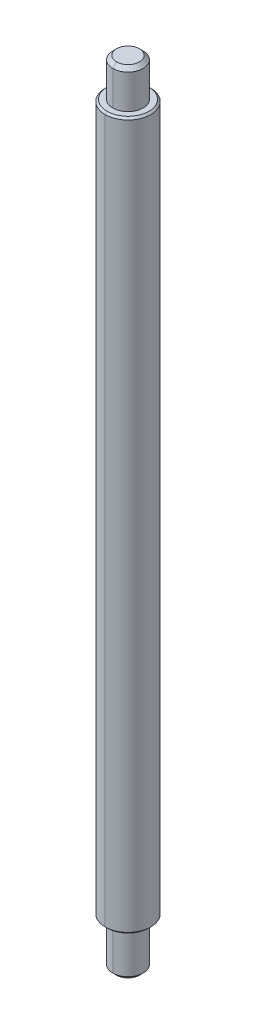
ISO-10303-21;
HEADER;
FILE_DESCRIPTION(('STEP AP214'),'2;1');
FILE_NAME('part.step','',(''),(''),'','','');
FILE_SCHEMA(('AUTOMOTIVE_DESIGN { 1 0 10303 214 1 1 1 1 }'));
ENDSEC;
DATA;
#1=APPLICATION_CONTEXT('core data for automotive mechanical design processes');
#2=APPLICATION_PROTOCOL_DEFINITION('international standard','automotive_design',2000,#1);
#3=PRODUCT_CONTEXT('',#1,'mechanical');
#4=PRODUCT('Part','Part','',(#3));
#5=PRODUCT_RELATED_PRODUCT_CATEGORY('part','',(#4));
#6=PRODUCT_DEFINITION_FORMATION('','',#4);
#7=PRODUCT_DEFINITION_CONTEXT('part definition',#1,'design');
#8=PRODUCT_DEFINITION('design','',#6,#7);
#9=PRODUCT_DEFINITION_SHAPE('','',#8);
#10=(LENGTH_UNIT() NAMED_UNIT(*) SI_UNIT(.MILLI.,.METRE.));
#11=(NAMED_UNIT(*) PLANE_ANGLE_UNIT() SI_UNIT($,.RADIAN.));
#12=(NAMED_UNIT(*) SI_UNIT($,.STERADIAN.) SOLID_ANGLE_UNIT());
#13=UNCERTAINTY_MEASURE_WITH_UNIT(LENGTH_MEASURE(1.E-05),#10,'distance_accuracy_value','');
#14=(GEOMETRIC_REPRESENTATION_CONTEXT(3) GLOBAL_UNCERTAINTY_ASSIGNED_CONTEXT((#13)) GLOBAL_UNIT_ASSIGNED_CONTEXT((#10,
#11,#12)) REPRESENTATION_CONTEXT('',''));
#15=CARTESIAN_POINT('',(0.,0.,0.));
#16=DIRECTION('',(0.,0.,1.));
#17=DIRECTION('',(1.,0.,0.));
#18=AXIS2_PLACEMENT_3D('',#15,#16,#17);
#19=CARTESIAN_POINT('',(0.,6.25,0.));
#20=DIRECTION('',(0.,1.,0.));
#21=DIRECTION('',(0.,0.,1.));
#22=AXIS2_PLACEMENT_3D('',#19,#20,#21);
#23=CONICAL_SURFACE('',#22,3.,0.785398163397442);
#24=CARTESIAN_POINT('',(0.,6.,0.));
#25=DIRECTION('',(0.,-1.,0.));
#26=DIRECTION('',(0.,0.,-1.));
#27=AXIS2_PLACEMENT_3D('',#24,#25,#26);
#28=CIRCLE('',#27,2.75);
#29=CARTESIAN_POINT('',(0.,6.,-2.75));
#30=VERTEX_POINT('',#29);
#31=CARTESIAN_POINT('',(0.,6.,2.75));
#32=VERTEX_POINT('',#31);
#33=EDGE_CURVE('E41',#30,#32,#28,.T.);
#34=ORIENTED_EDGE('',*,*,#33,.F.);
#35=DIRECTION('',(0.,0.707106781186552,-0.707106781186543));
#36=VECTOR('',#35,1.);
#37=CARTESIAN_POINT('',(0.,6.25,-3.));
#38=LINE('',#37,#36);
#39=CARTESIAN_POINT('',(0.,6.25,-3.));
#40=VERTEX_POINT('',#39);
#41=EDGE_CURVE('E11',#30,#40,#38,.T.);
#42=ORIENTED_EDGE('',*,*,#41,.T.);
#43=CARTESIAN_POINT('',(0.,6.25,0.));
#44=DIRECTION('',(0.,1.,0.));
#45=DIRECTION('',(0.,0.,-1.));
#46=AXIS2_PLACEMENT_3D('',#43,#44,#45);
#47=CIRCLE('',#46,3.);
#48=CARTESIAN_POINT('',(0.,6.25,3.));
#49=VERTEX_POINT('',#48);
#50=EDGE_CURVE('E233',#49,#40,#47,.T.);
#51=ORIENTED_EDGE('',*,*,#50,.F.);
#52=DIRECTION('',(0.,0.707106781186552,0.707106781186543));
#53=VECTOR('',#52,1.);
#54=CARTESIAN_POINT('',(0.,6.25,3.));
#55=LINE('',#54,#53);
#56=EDGE_CURVE('E182',#32,#49,#55,.T.);
#57=ORIENTED_EDGE('',*,*,#56,.F.);
#58=EDGE_LOOP('',(#34,#42,#51,#57));
#59=FACE_BOUND('',#58,.T.);
#60=ADVANCED_FACE('F16',(#59),#23,.T.);
#61=CARTESIAN_POINT('',(0.,99.,0.));
#62=DIRECTION('',(0.,-1.,0.));
#63=DIRECTION('',(0.,0.,-1.));
#64=AXIS2_PLACEMENT_3D('',#61,#62,#63);
#65=CONICAL_SURFACE('',#64,2.75,0.785398163397426);
#66=CARTESIAN_POINT('',(0.,99.,0.));
#67=DIRECTION('',(0.,1.,0.));
#68=DIRECTION('',(0.,0.,1.));
#69=AXIS2_PLACEMENT_3D('',#66,#67,#68);
#70=CIRCLE('',#69,2.75);
#71=CARTESIAN_POINT('',(0.,99.,2.75));
#72=VERTEX_POINT('',#71);
#73=CARTESIAN_POINT('',(0.,99.,-2.75));
#74=VERTEX_POINT('',#73);
#75=EDGE_CURVE('E193',#72,#74,#70,.T.);
#76=ORIENTED_EDGE('',*,*,#75,.F.);
#77=DIRECTION('',(0.,-0.707106781186563,0.707106781186532));
#78=VECTOR('',#77,1.);
#79=CARTESIAN_POINT('',(0.,99.,2.75));
#80=LINE('',#79,#78);
#81=CARTESIAN_POINT('',(0.,98.75,3.));
#82=VERTEX_POINT('',#81);
#83=EDGE_CURVE('E27',#72,#82,#80,.T.);
#84=ORIENTED_EDGE('',*,*,#83,.T.);
#85=CARTESIAN_POINT('',(0.,98.75,0.));
#86=DIRECTION('',(0.,-1.,0.));
#87=DIRECTION('',(0.,0.,1.));
#88=AXIS2_PLACEMENT_3D('',#85,#86,#87);
#89=CIRCLE('',#88,3.);
#90=CARTESIAN_POINT('',(0.,98.75,-3.));
#91=VERTEX_POINT('',#90);
#92=EDGE_CURVE('E177',#91,#82,#89,.T.);
#93=ORIENTED_EDGE('',*,*,#92,.F.);
#94=DIRECTION('',(0.,-0.707106781186563,-0.707106781186532));
#95=VECTOR('',#94,1.);
#96=CARTESIAN_POINT('',(0.,99.,-2.75));
#97=LINE('',#96,#95);
#98=EDGE_CURVE('E179',#74,#91,#97,.T.);
#99=ORIENTED_EDGE('',*,*,#98,.F.);
#100=EDGE_LOOP('',(#76,#84,#93,#99));
#101=FACE_BOUND('',#100,.T.);
#102=ADVANCED_FACE('F416',(#101),#65,.T.);
#103=CARTESIAN_POINT('',(0.,0.499999999999993,0.));
#104=DIRECTION('',(0.,1.,0.));
#105=DIRECTION('',(0.,0.,1.));
#106=AXIS2_PLACEMENT_3D('',#103,#104,#105);
#107=CONICAL_SURFACE('',#106,2.,0.785398163397442);
#108=CARTESIAN_POINT('',(0.,0.,0.));
#109=DIRECTION('',(0.,-1.,0.));
#110=DIRECTION('',(0.,0.,-1.));
#111=AXIS2_PLACEMENT_3D('',#108,#109,#110);
#112=CIRCLE('',#111,1.5);
#113=CARTESIAN_POINT('',(0.,0.,-1.5));
#114=VERTEX_POINT('',#113);
#115=CARTESIAN_POINT('',(0.,0.,1.5));
#116=VERTEX_POINT('',#115);
#117=EDGE_CURVE('E145',#114,#116,#112,.T.);
#118=ORIENTED_EDGE('',*,*,#117,.F.);
#119=DIRECTION('',(0.,0.707106781186553,-0.707106781186543));
#120=VECTOR('',#119,1.);
#121=CARTESIAN_POINT('',(0.,0.499999999999993,-2.));
#122=LINE('',#121,#120);
#123=CARTESIAN_POINT('',(0.,0.499999999999993,-2.));
#124=VERTEX_POINT('',#123);
#125=EDGE_CURVE('E20',#114,#124,#122,.T.);
#126=ORIENTED_EDGE('',*,*,#125,.T.);
#127=CARTESIAN_POINT('',(0.,0.499999999999993,0.));
#128=DIRECTION('',(0.,1.,0.));
#129=DIRECTION('',(0.,0.,-1.));
#130=AXIS2_PLACEMENT_3D('',#127,#128,#129);
#131=CIRCLE('',#130,2.);
#132=CARTESIAN_POINT('',(0.,0.499999999999993,2.));
#133=VERTEX_POINT('',#132);
#134=EDGE_CURVE('E221',#133,#124,#131,.T.);
#135=ORIENTED_EDGE('',*,*,#134,.F.);
#136=DIRECTION('',(0.,0.707106781186553,0.707106781186543));
#137=VECTOR('',#136,1.);
#138=CARTESIAN_POINT('',(0.,0.499999999999993,2.));
#139=LINE('',#138,#137);
#140=EDGE_CURVE('E111',#116,#133,#139,.T.);
#141=ORIENTED_EDGE('',*,*,#140,.F.);
#142=EDGE_LOOP('',(#118,#126,#135,#141));
#143=FACE_BOUND('',#142,.T.);
#144=ADVANCED_FACE('F421',(#143),#107,.T.);
#145=CARTESIAN_POINT('',(0.,104.,0.));
#146=DIRECTION('',(0.,-1.,0.));
#147=DIRECTION('',(0.,0.,-1.));
#148=AXIS2_PLACEMENT_3D('',#145,#146,#147);
#149=CONICAL_SURFACE('',#148,1.50000000000003,0.785398163397445);
#150=CARTESIAN_POINT('',(0.,104.,0.));
#151=DIRECTION('',(0.,1.,0.));
#152=DIRECTION('',(0.,0.,1.));
#153=AXIS2_PLACEMENT_3D('',#150,#151,#152);
#154=CIRCLE('',#153,1.50000000000003);
#155=CARTESIAN_POINT('',(0.,104.,1.50000000000003));
#156=VERTEX_POINT('',#155);
#157=CARTESIAN_POINT('',(0.,104.,-1.50000000000003));
#158=VERTEX_POINT('',#157);
#159=EDGE_CURVE('E125',#156,#158,#154,.T.);
#160=ORIENTED_EDGE('',*,*,#159,.F.);
#161=DIRECTION('',(0.,-0.70710678118655,0.707106781186545));
#162=VECTOR('',#161,1.);
#163=CARTESIAN_POINT('',(0.,104.,1.50000000000003));
#164=LINE('',#163,#162);
#165=CARTESIAN_POINT('',(0.,103.5,2.));
#166=VERTEX_POINT('',#165);
#167=EDGE_CURVE('E143',#156,#166,#164,.T.);
#168=ORIENTED_EDGE('',*,*,#167,.T.);
#169=CARTESIAN_POINT('',(0.,103.5,0.));
#170=DIRECTION('',(0.,-1.,0.));
#171=DIRECTION('',(0.,0.,1.));
#172=AXIS2_PLACEMENT_3D('',#169,#170,#171);
#173=CIRCLE('',#172,2.);
#174=CARTESIAN_POINT('',(0.,103.5,-2.));
#175=VERTEX_POINT('',#174);
#176=EDGE_CURVE('E128',#175,#166,#173,.T.);
#177=ORIENTED_EDGE('',*,*,#176,.F.);
#178=DIRECTION('',(0.,-0.70710678118655,-0.707106781186545));
#179=VECTOR('',#178,1.);
#180=CARTESIAN_POINT('',(0.,104.,-1.50000000000003));
#181=LINE('',#180,#179);
#182=EDGE_CURVE('E121',#158,#175,#181,.T.);
#183=ORIENTED_EDGE('',*,*,#182,.F.);
#184=EDGE_LOOP('',(#160,#168,#177,#183));
#185=FACE_BOUND('',#184,.T.);
#186=ADVANCED_FACE('F123',(#185),#149,.T.);
#187=CARTESIAN_POINT('',(0.,0.,0.));
#188=DIRECTION('',(0.,1.,0.));
#189=DIRECTION('',(0.,0.,1.));
#190=AXIS2_PLACEMENT_3D('',#187,#188,#189);
#191=CYLINDRICAL_SURFACE('',#190,2.);
#192=ORIENTED_EDGE('',*,*,#134,.T.);
#193=DIRECTION('',(0.,1.,0.));
#194=VECTOR('',#193,1.);
#195=CARTESIAN_POINT('',(0.,0.,-2.));
#196=LINE('',#195,#194);
#197=CARTESIAN_POINT('',(0.,6.,-2.));
#198=VERTEX_POINT('',#197);
#199=EDGE_CURVE('E99',#124,#198,#196,.T.);
#200=ORIENTED_EDGE('',*,*,#199,.T.);
#201=CARTESIAN_POINT('',(0.,6.,0.));
#202=DIRECTION('',(0.,1.,0.));
#203=DIRECTION('',(0.,0.,1.));
#204=AXIS2_PLACEMENT_3D('',#201,#202,#203);
#205=CIRCLE('',#204,2.);
#206=CARTESIAN_POINT('',(0.,6.,2.));
#207=VERTEX_POINT('',#206);
#208=EDGE_CURVE('E165',#207,#198,#205,.T.);
#209=ORIENTED_EDGE('',*,*,#208,.F.);
#210=DIRECTION('',(0.,1.,0.));
#211=VECTOR('',#210,1.);
#212=CARTESIAN_POINT('',(0.,0.,2.));
#213=LINE('',#212,#211);
#214=EDGE_CURVE('E134',#133,#207,#213,.T.);
#215=ORIENTED_EDGE('',*,*,#214,.F.);
#216=EDGE_LOOP('',(#192,#200,#209,#215));
#217=FACE_BOUND('',#216,.T.);
#218=ADVANCED_FACE('F438',(#217),#191,.T.);
#219=CARTESIAN_POINT('',(0.,0.,0.));
#220=DIRECTION('',(0.,1.,0.));
#221=DIRECTION('',(0.,0.,1.));
#222=AXIS2_PLACEMENT_3D('',#219,#220,#221);
#223=CYLINDRICAL_SURFACE('',#222,3.);
#224=ORIENTED_EDGE('',*,*,#50,.T.);
#225=DIRECTION('',(0.,1.,0.));
#226=VECTOR('',#225,1.);
#227=CARTESIAN_POINT('',(0.,0.,-3.));
#228=LINE('',#227,#226);
#229=EDGE_CURVE('E225',#40,#91,#228,.T.);
#230=ORIENTED_EDGE('',*,*,#229,.T.);
#231=ORIENTED_EDGE('',*,*,#92,.T.);
#232=DIRECTION('',(0.,1.,0.));
#233=VECTOR('',#232,1.);
#234=CARTESIAN_POINT('',(0.,0.,3.));
#235=LINE('',#234,#233);
#236=EDGE_CURVE('E198',#49,#82,#235,.T.);
#237=ORIENTED_EDGE('',*,*,#236,.F.);
#238=EDGE_LOOP('',(#224,#230,#231,#237));
#239=FACE_BOUND('',#238,.T.);
#240=ADVANCED_FACE('F432',(#239),#223,.T.);
#241=CARTESIAN_POINT('',(0.,0.,0.));
#242=DIRECTION('',(0.,1.,0.));
#243=DIRECTION('',(0.,0.,1.));
#244=AXIS2_PLACEMENT_3D('',#241,#242,#243);
#245=CYLINDRICAL_SURFACE('',#244,2.);
#246=CARTESIAN_POINT('',(0.,99.,0.));
#247=DIRECTION('',(0.,1.,0.));
#248=DIRECTION('',(0.,0.,1.));
#249=AXIS2_PLACEMENT_3D('',#246,#247,#248);
#250=CIRCLE('',#249,2.);
#251=CARTESIAN_POINT('',(0.,99.,2.));
#252=VERTEX_POINT('',#251);
#253=CARTESIAN_POINT('',(0.,99.,-2.));
#254=VERTEX_POINT('',#253);
#255=EDGE_CURVE('E173',#252,#254,#250,.T.);
#256=ORIENTED_EDGE('',*,*,#255,.T.);
#257=DIRECTION('',(0.,1.,0.));
#258=VECTOR('',#257,1.);
#259=CARTESIAN_POINT('',(0.,0.,-2.));
#260=LINE('',#259,#258);
#261=EDGE_CURVE('E178',#254,#175,#260,.T.);
#262=ORIENTED_EDGE('',*,*,#261,.T.);
#263=ORIENTED_EDGE('',*,*,#176,.T.);
#264=DIRECTION('',(0.,1.,0.));
#265=VECTOR('',#264,1.);
#266=CARTESIAN_POINT('',(0.,0.,2.));
#267=LINE('',#266,#265);
#268=EDGE_CURVE('E172',#252,#166,#267,.T.);
#269=ORIENTED_EDGE('',*,*,#268,.F.);
#270=EDGE_LOOP('',(#256,#262,#263,#269));
#271=FACE_BOUND('',#270,.T.);
#272=ADVANCED_FACE('F437',(#271),#245,.T.);
#273=CARTESIAN_POINT('',(-2.,0.,0.));
#274=DIRECTION('',(0.,-1.,0.));
#275=DIRECTION('',(0.,0.,-1.));
#276=AXIS2_PLACEMENT_3D('',#273,#274,#275);
#277=PLANE('',#276);
#278=CARTESIAN_POINT('',(0.,0.,0.));
#279=DIRECTION('',(0.,-1.,0.));
#280=DIRECTION('',(0.,0.,-1.));
#281=AXIS2_PLACEMENT_3D('',#278,#279,#280);
#282=CIRCLE('',#281,1.5);
#283=EDGE_CURVE('E152',#116,#114,#282,.T.);
#284=ORIENTED_EDGE('',*,*,#283,.T.);
#285=ORIENTED_EDGE('',*,*,#117,.T.);
#286=EDGE_LOOP('',(#284,#285));
#287=FACE_BOUND('',#286,.T.);
#288=ADVANCED_FACE('F468',(#287),#277,.T.);
#289=CARTESIAN_POINT('',(0.,104.,0.));
#290=DIRECTION('',(0.,1.,0.));
#291=DIRECTION('',(1.,0.,0.));
#292=AXIS2_PLACEMENT_3D('',#289,#290,#291);
#293=PLANE('',#292);
#294=CARTESIAN_POINT('',(0.,104.,0.));
#295=DIRECTION('',(0.,1.,0.));
#296=DIRECTION('',(0.,0.,1.));
#297=AXIS2_PLACEMENT_3D('',#294,#295,#296);
#298=CIRCLE('',#297,1.50000000000003);
#299=EDGE_CURVE('E139',#158,#156,#298,.T.);
#300=ORIENTED_EDGE('',*,*,#299,.T.);
#301=ORIENTED_EDGE('',*,*,#159,.T.);
#302=EDGE_LOOP('',(#300,#301));
#303=FACE_BOUND('',#302,.T.);
#304=ADVANCED_FACE('F138',(#303),#293,.T.);
#305=CARTESIAN_POINT('',(0.,0.,0.));
#306=DIRECTION('',(0.,1.,0.));
#307=DIRECTION('',(0.,0.,1.));
#308=AXIS2_PLACEMENT_3D('',#305,#306,#307);
#309=CYLINDRICAL_SURFACE('',#308,2.);
#310=ORIENTED_EDGE('',*,*,#261,.F.);
#311=CARTESIAN_POINT('',(0.,99.,0.));
#312=DIRECTION('',(0.,1.,0.));
#313=DIRECTION('',(0.,0.,1.));
#314=AXIS2_PLACEMENT_3D('',#311,#312,#313);
#315=CIRCLE('',#314,2.);
#316=EDGE_CURVE('E141',#254,#252,#315,.T.);
#317=ORIENTED_EDGE('',*,*,#316,.T.);
#318=ORIENTED_EDGE('',*,*,#268,.T.);
#319=CARTESIAN_POINT('',(0.,103.5,0.));
#320=DIRECTION('',(0.,-1.,0.));
#321=DIRECTION('',(0.,0.,1.));
#322=AXIS2_PLACEMENT_3D('',#319,#320,#321);
#323=CIRCLE('',#322,2.);
#324=EDGE_CURVE('E185',#166,#175,#323,.T.);
#325=ORIENTED_EDGE('',*,*,#324,.T.);
#326=EDGE_LOOP('',(#310,#317,#318,#325));
#327=FACE_BOUND('',#326,.T.);
#328=ADVANCED_FACE('F467',(#327),#309,.T.);
#329=CARTESIAN_POINT('',(-2.,99.,0.));
#330=DIRECTION('',(0.,1.,0.));
#331=DIRECTION('',(1.,0.,0.));
#332=AXIS2_PLACEMENT_3D('',#329,#330,#331);
#333=PLANE('',#332);
#334=CARTESIAN_POINT('',(0.,99.,0.));
#335=DIRECTION('',(0.,1.,0.));
#336=DIRECTION('',(0.,0.,1.));
#337=AXIS2_PLACEMENT_3D('',#334,#335,#336);
#338=CIRCLE('',#337,2.75);
#339=EDGE_CURVE('E189',#74,#72,#338,.T.);
#340=ORIENTED_EDGE('',*,*,#339,.T.);
#341=ORIENTED_EDGE('',*,*,#75,.T.);
#342=EDGE_LOOP('',(#340,#341));
#343=FACE_BOUND('',#342,.T.);
#344=ORIENTED_EDGE('',*,*,#255,.F.);
#345=ORIENTED_EDGE('',*,*,#316,.F.);
#346=EDGE_LOOP('',(#344,#345));
#347=FACE_BOUND('',#346,.T.);
#348=ADVANCED_FACE('F454',(#343,#347),#333,.T.);
#349=CARTESIAN_POINT('',(0.,0.,0.));
#350=DIRECTION('',(0.,1.,0.));
#351=DIRECTION('',(0.,0.,1.));
#352=AXIS2_PLACEMENT_3D('',#349,#350,#351);
#353=CYLINDRICAL_SURFACE('',#352,3.);
#354=ORIENTED_EDGE('',*,*,#229,.F.);
#355=CARTESIAN_POINT('',(0.,6.25,0.));
#356=DIRECTION('',(0.,1.,0.));
#357=DIRECTION('',(0.,0.,-1.));
#358=AXIS2_PLACEMENT_3D('',#355,#356,#357);
#359=CIRCLE('',#358,3.);
#360=EDGE_CURVE('E194',#40,#49,#359,.T.);
#361=ORIENTED_EDGE('',*,*,#360,.T.);
#362=ORIENTED_EDGE('',*,*,#236,.T.);
#363=CARTESIAN_POINT('',(0.,98.75,0.));
#364=DIRECTION('',(0.,-1.,0.));
#365=DIRECTION('',(0.,0.,1.));
#366=AXIS2_PLACEMENT_3D('',#363,#364,#365);
#367=CIRCLE('',#366,3.);
#368=EDGE_CURVE('E201',#82,#91,#367,.T.);
#369=ORIENTED_EDGE('',*,*,#368,.T.);
#370=EDGE_LOOP('',(#354,#361,#362,#369));
#371=FACE_BOUND('',#370,.T.);
#372=ADVANCED_FACE('F448',(#371),#353,.T.);
#373=CARTESIAN_POINT('',(-3.,6.,0.));
#374=DIRECTION('',(0.,-1.,0.));
#375=DIRECTION('',(0.,0.,-1.));
#376=AXIS2_PLACEMENT_3D('',#373,#374,#375);
#377=PLANE('',#376);
#378=CARTESIAN_POINT('',(0.,6.,0.));
#379=DIRECTION('',(0.,-1.,0.));
#380=DIRECTION('',(0.,0.,-1.));
#381=AXIS2_PLACEMENT_3D('',#378,#379,#380);
#382=CIRCLE('',#381,2.75);
#383=EDGE_CURVE('E164',#32,#30,#382,.T.);
#384=ORIENTED_EDGE('',*,*,#383,.T.);
#385=ORIENTED_EDGE('',*,*,#33,.T.);
#386=EDGE_LOOP('',(#384,#385));
#387=FACE_BOUND('',#386,.T.);
#388=ORIENTED_EDGE('',*,*,#208,.T.);
#389=CARTESIAN_POINT('',(0.,6.,0.));
#390=DIRECTION('',(0.,1.,0.));
#391=DIRECTION('',(0.,0.,1.));
#392=AXIS2_PLACEMENT_3D('',#389,#390,#391);
#393=CIRCLE('',#392,2.);
#394=EDGE_CURVE('E168',#198,#207,#393,.T.);
#395=ORIENTED_EDGE('',*,*,#394,.T.);
#396=EDGE_LOOP('',(#388,#395));
#397=FACE_BOUND('',#396,.T.);
#398=ADVANCED_FACE('F453',(#387,#397),#377,.T.);
#399=CARTESIAN_POINT('',(0.,0.,0.));
#400=DIRECTION('',(0.,1.,0.));
#401=DIRECTION('',(0.,0.,1.));
#402=AXIS2_PLACEMENT_3D('',#399,#400,#401);
#403=CYLINDRICAL_SURFACE('',#402,2.);
#404=ORIENTED_EDGE('',*,*,#199,.F.);
#405=CARTESIAN_POINT('',(0.,0.499999999999993,0.));
#406=DIRECTION('',(0.,1.,0.));
#407=DIRECTION('',(0.,0.,-1.));
#408=AXIS2_PLACEMENT_3D('',#405,#406,#407);
#409=CIRCLE('',#408,2.);
#410=EDGE_CURVE('E227',#124,#133,#409,.T.);
#411=ORIENTED_EDGE('',*,*,#410,.T.);
#412=ORIENTED_EDGE('',*,*,#214,.T.);
#413=ORIENTED_EDGE('',*,*,#394,.F.);
#414=EDGE_LOOP('',(#404,#411,#412,#413));
#415=FACE_BOUND('',#414,.T.);
#416=ADVANCED_FACE('F500',(#415),#403,.T.);
#417=CARTESIAN_POINT('',(0.,104.,0.));
#418=DIRECTION('',(0.,-1.,0.));
#419=DIRECTION('',(0.,0.,-1.));
#420=AXIS2_PLACEMENT_3D('',#417,#418,#419);
#421=CONICAL_SURFACE('',#420,1.50000000000003,0.785398163397445);
#422=ORIENTED_EDGE('',*,*,#167,.F.);
#423=ORIENTED_EDGE('',*,*,#299,.F.);
#424=ORIENTED_EDGE('',*,*,#182,.T.);
#425=ORIENTED_EDGE('',*,*,#324,.F.);
#426=EDGE_LOOP('',(#422,#423,#424,#425));
#427=FACE_BOUND('',#426,.T.);
#428=ADVANCED_FACE('F18',(#427),#421,.T.);
#429=CARTESIAN_POINT('',(0.,0.499999999999993,0.));
#430=DIRECTION('',(0.,1.,0.));
#431=DIRECTION('',(0.,0.,1.));
#432=AXIS2_PLACEMENT_3D('',#429,#430,#431);
#433=CONICAL_SURFACE('',#432,2.,0.785398163397442);
#434=ORIENTED_EDGE('',*,*,#125,.F.);
#435=ORIENTED_EDGE('',*,*,#283,.F.);
#436=ORIENTED_EDGE('',*,*,#140,.T.);
#437=ORIENTED_EDGE('',*,*,#410,.F.);
#438=EDGE_LOOP('',(#434,#435,#436,#437));
#439=FACE_BOUND('',#438,.T.);
#440=ADVANCED_FACE('F534',(#439),#433,.T.);
#441=CARTESIAN_POINT('',(0.,99.,0.));
#442=DIRECTION('',(0.,-1.,0.));
#443=DIRECTION('',(0.,0.,-1.));
#444=AXIS2_PLACEMENT_3D('',#441,#442,#443);
#445=CONICAL_SURFACE('',#444,2.75,0.785398163397426);
#446=ORIENTED_EDGE('',*,*,#83,.F.);
#447=ORIENTED_EDGE('',*,*,#339,.F.);
#448=ORIENTED_EDGE('',*,*,#98,.T.);
#449=ORIENTED_EDGE('',*,*,#368,.F.);
#450=EDGE_LOOP('',(#446,#447,#448,#449));
#451=FACE_BOUND('',#450,.T.);
#452=ADVANCED_FACE('F513',(#451),#445,.T.);
#453=CARTESIAN_POINT('',(0.,6.25,0.));
#454=DIRECTION('',(0.,1.,0.));
#455=DIRECTION('',(0.,0.,1.));
#456=AXIS2_PLACEMENT_3D('',#453,#454,#455);
#457=CONICAL_SURFACE('',#456,3.,0.785398163397442);
#458=ORIENTED_EDGE('',*,*,#41,.F.);
#459=ORIENTED_EDGE('',*,*,#383,.F.);
#460=ORIENTED_EDGE('',*,*,#56,.T.);
#461=ORIENTED_EDGE('',*,*,#360,.F.);
#462=EDGE_LOOP('',(#458,#459,#460,#461));
#463=FACE_BOUND('',#462,.T.);
#464=ADVANCED_FACE('F508',(#463),#457,.T.);
#465=CLOSED_SHELL('',(#60,#102,#144,#186,#218,#240,#272,#288,#304,#328,#348,#372,#398,#416,#428,
#440,#452,#464));
#466=MANIFOLD_SOLID_BREP('B1',#465);
#467=ADVANCED_BREP_SHAPE_REPRESENTATION('',(#18,#466),#14);
#468=SHAPE_DEFINITION_REPRESENTATION(#9,#467);
ENDSEC;
END-ISO-10303-21;
